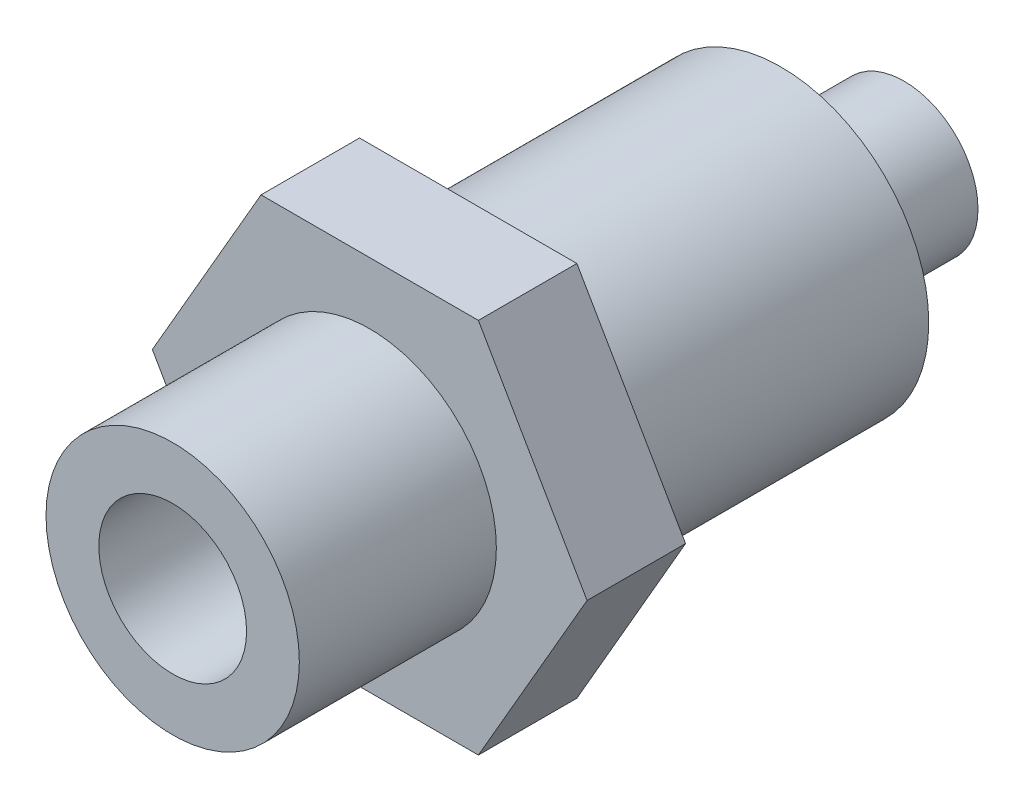
ISO-10303-21;
HEADER;
FILE_DESCRIPTION(('STEP AP214'),'2;1');
FILE_NAME('part.step','',(''),(''),'','','');
FILE_SCHEMA(('AUTOMOTIVE_DESIGN { 1 0 10303 214 1 1 1 1 }'));
ENDSEC;
DATA;
#1=APPLICATION_CONTEXT('core data for automotive mechanical design processes');
#2=APPLICATION_PROTOCOL_DEFINITION('international standard','automotive_design',2000,#1);
#3=PRODUCT_CONTEXT('',#1,'mechanical');
#4=PRODUCT('Part','Part','',(#3));
#5=PRODUCT_RELATED_PRODUCT_CATEGORY('part','',(#4));
#6=PRODUCT_DEFINITION_FORMATION('','',#4);
#7=PRODUCT_DEFINITION_CONTEXT('part definition',#1,'design');
#8=PRODUCT_DEFINITION('design','',#6,#7);
#9=PRODUCT_DEFINITION_SHAPE('','',#8);
#10=(LENGTH_UNIT() NAMED_UNIT(*) SI_UNIT(.MILLI.,.METRE.));
#11=(NAMED_UNIT(*) PLANE_ANGLE_UNIT() SI_UNIT($,.RADIAN.));
#12=(NAMED_UNIT(*) SI_UNIT($,.STERADIAN.) SOLID_ANGLE_UNIT());
#13=UNCERTAINTY_MEASURE_WITH_UNIT(LENGTH_MEASURE(1.E-05),#10,'distance_accuracy_value','');
#14=(GEOMETRIC_REPRESENTATION_CONTEXT(3) GLOBAL_UNCERTAINTY_ASSIGNED_CONTEXT((#13)) GLOBAL_UNIT_ASSIGNED_CONTEXT((#10,
#11,#12)) REPRESENTATION_CONTEXT('',''));
#15=CARTESIAN_POINT('',(0.,0.,0.));
#16=DIRECTION('',(0.,0.,1.));
#17=DIRECTION('',(1.,0.,0.));
#18=AXIS2_PLACEMENT_3D('',#15,#16,#17);
#19=CARTESIAN_POINT('',(0.,-7.6435,-4.));
#20=DIRECTION('',(0.,-1.,0.));
#21=DIRECTION('',(1.,0.,0.));
#22=AXIS2_PLACEMENT_3D('',#19,#20,#21);
#23=PLANE('',#22);
#24=DIRECTION('',(1.,0.,0.));
#25=VECTOR('',#24,1.);
#26=CARTESIAN_POINT('',(0.,-7.6435,0.));
#27=LINE('',#26,#25);
#28=CARTESIAN_POINT('',(-4.41297678255091,-7.6435,0.));
#29=VERTEX_POINT('',#28);
#30=CARTESIAN_POINT('',(4.41297678255091,-7.6435,0.));
#31=VERTEX_POINT('',#30);
#32=EDGE_CURVE('E180',#29,#31,#27,.T.);
#33=ORIENTED_EDGE('',*,*,#32,.F.);
#34=DIRECTION('',(0.,0.,1.));
#35=VECTOR('',#34,1.);
#36=CARTESIAN_POINT('',(-4.41297678255091,-7.6435,-4.));
#37=LINE('',#36,#35);
#38=CARTESIAN_POINT('',(-4.41297678255091,-7.6435,-4.));
#39=VERTEX_POINT('',#38);
#40=EDGE_CURVE('E13',#39,#29,#37,.T.);
#41=ORIENTED_EDGE('',*,*,#40,.F.);
#42=DIRECTION('',(1.,0.,0.));
#43=VECTOR('',#42,1.);
#44=CARTESIAN_POINT('',(0.,-7.6435,-4.));
#45=LINE('',#44,#43);
#46=CARTESIAN_POINT('',(4.41297678255091,-7.6435,-4.));
#47=VERTEX_POINT('',#46);
#48=EDGE_CURVE('E195',#39,#47,#45,.T.);
#49=ORIENTED_EDGE('',*,*,#48,.T.);
#50=DIRECTION('',(0.,0.,1.));
#51=VECTOR('',#50,1.);
#52=CARTESIAN_POINT('',(4.41297678255091,-7.6435,-4.));
#53=LINE('',#52,#51);
#54=EDGE_CURVE('E144',#47,#31,#53,.T.);
#55=ORIENTED_EDGE('',*,*,#54,.T.);
#56=EDGE_LOOP('',(#33,#41,#49,#55));
#57=FACE_BOUND('',#56,.T.);
#58=ADVANCED_FACE('F93',(#57),#23,.T.);
#59=CARTESIAN_POINT('',(-6.61946517382636,-3.82175,-4.));
#60=DIRECTION('',(-0.866025403784439,-0.5,0.));
#61=DIRECTION('',(0.5,-0.866025403784439,0.));
#62=AXIS2_PLACEMENT_3D('',#59,#60,#61);
#63=PLANE('',#62);
#64=DIRECTION('',(0.5,-0.866025403784439,0.));
#65=VECTOR('',#64,1.);
#66=CARTESIAN_POINT('',(-6.61946517382636,-3.82175,0.));
#67=LINE('',#66,#65);
#68=CARTESIAN_POINT('',(-8.82595356510181,0.,0.));
#69=VERTEX_POINT('',#68);
#70=EDGE_CURVE('E193',#69,#29,#67,.T.);
#71=ORIENTED_EDGE('',*,*,#70,.F.);
#72=DIRECTION('',(0.,0.,1.));
#73=VECTOR('',#72,1.);
#74=CARTESIAN_POINT('',(-8.82595356510181,0.,-4.));
#75=LINE('',#74,#73);
#76=CARTESIAN_POINT('',(-8.82595356510181,0.,-4.));
#77=VERTEX_POINT('',#76);
#78=EDGE_CURVE('E103',#77,#69,#75,.T.);
#79=ORIENTED_EDGE('',*,*,#78,.F.);
#80=DIRECTION('',(0.5,-0.866025403784439,0.));
#81=VECTOR('',#80,1.);
#82=CARTESIAN_POINT('',(-6.61946517382636,-3.82175,-4.));
#83=LINE('',#82,#81);
#84=EDGE_CURVE('E170',#77,#39,#83,.T.);
#85=ORIENTED_EDGE('',*,*,#84,.T.);
#86=ORIENTED_EDGE('',*,*,#40,.T.);
#87=EDGE_LOOP('',(#71,#79,#85,#86));
#88=FACE_BOUND('',#87,.T.);
#89=ADVANCED_FACE('F225',(#88),#63,.T.);
#90=CARTESIAN_POINT('',(-6.61946517382636,3.82175,-4.));
#91=DIRECTION('',(-0.866025403784439,0.5,0.));
#92=DIRECTION('',(-0.5,-0.866025403784439,0.));
#93=AXIS2_PLACEMENT_3D('',#90,#91,#92);
#94=PLANE('',#93);
#95=DIRECTION('',(-0.5,-0.866025403784439,0.));
#96=VECTOR('',#95,1.);
#97=CARTESIAN_POINT('',(-6.61946517382636,3.82175,0.));
#98=LINE('',#97,#96);
#99=CARTESIAN_POINT('',(-4.41297678255091,7.6435,0.));
#100=VERTEX_POINT('',#99);
#101=EDGE_CURVE('E157',#100,#69,#98,.T.);
#102=ORIENTED_EDGE('',*,*,#101,.F.);
#103=DIRECTION('',(0.,0.,1.));
#104=VECTOR('',#103,1.);
#105=CARTESIAN_POINT('',(-4.41297678255091,7.6435,-4.));
#106=LINE('',#105,#104);
#107=CARTESIAN_POINT('',(-4.41297678255091,7.6435,-4.));
#108=VERTEX_POINT('',#107);
#109=EDGE_CURVE('E152',#108,#100,#106,.T.);
#110=ORIENTED_EDGE('',*,*,#109,.F.);
#111=DIRECTION('',(-0.5,-0.866025403784439,0.));
#112=VECTOR('',#111,1.);
#113=CARTESIAN_POINT('',(-6.61946517382636,3.82175,-4.));
#114=LINE('',#113,#112);
#115=EDGE_CURVE('E155',#108,#77,#114,.T.);
#116=ORIENTED_EDGE('',*,*,#115,.T.);
#117=ORIENTED_EDGE('',*,*,#78,.T.);
#118=EDGE_LOOP('',(#102,#110,#116,#117));
#119=FACE_BOUND('',#118,.T.);
#120=ADVANCED_FACE('F154',(#119),#94,.T.);
#121=CARTESIAN_POINT('',(0.,7.6435,-4.));
#122=DIRECTION('',(0.,1.,0.));
#123=DIRECTION('',(-1.,0.,0.));
#124=AXIS2_PLACEMENT_3D('',#121,#122,#123);
#125=PLANE('',#124);
#126=DIRECTION('',(-1.,0.,0.));
#127=VECTOR('',#126,1.);
#128=CARTESIAN_POINT('',(0.,7.6435,0.));
#129=LINE('',#128,#127);
#130=CARTESIAN_POINT('',(4.4129767825509,7.6435,0.));
#131=VERTEX_POINT('',#130);
#132=EDGE_CURVE('E190',#131,#100,#129,.T.);
#133=ORIENTED_EDGE('',*,*,#132,.F.);
#134=DIRECTION('',(0.,0.,1.));
#135=VECTOR('',#134,1.);
#136=CARTESIAN_POINT('',(4.4129767825509,7.6435,-4.));
#137=LINE('',#136,#135);
#138=CARTESIAN_POINT('',(4.4129767825509,7.6435,-4.));
#139=VERTEX_POINT('',#138);
#140=EDGE_CURVE('E162',#139,#131,#137,.T.);
#141=ORIENTED_EDGE('',*,*,#140,.F.);
#142=DIRECTION('',(-1.,0.,0.));
#143=VECTOR('',#142,1.);
#144=CARTESIAN_POINT('',(0.,7.6435,-4.));
#145=LINE('',#144,#143);
#146=EDGE_CURVE('E168',#139,#108,#145,.T.);
#147=ORIENTED_EDGE('',*,*,#146,.T.);
#148=ORIENTED_EDGE('',*,*,#109,.T.);
#149=EDGE_LOOP('',(#133,#141,#147,#148));
#150=FACE_BOUND('',#149,.T.);
#151=ADVANCED_FACE('F172',(#150),#125,.T.);
#152=CARTESIAN_POINT('',(6.61946517382636,3.82175,-4.));
#153=DIRECTION('',(0.866025403784439,0.5,0.));
#154=DIRECTION('',(-0.5,0.866025403784439,0.));
#155=AXIS2_PLACEMENT_3D('',#152,#153,#154);
#156=PLANE('',#155);
#157=DIRECTION('',(-0.5,0.866025403784439,0.));
#158=VECTOR('',#157,1.);
#159=CARTESIAN_POINT('',(6.61946517382636,3.82175,0.));
#160=LINE('',#159,#158);
#161=CARTESIAN_POINT('',(8.82595356510181,0.,0.));
#162=VERTEX_POINT('',#161);
#163=EDGE_CURVE('E187',#162,#131,#160,.T.);
#164=ORIENTED_EDGE('',*,*,#163,.F.);
#165=DIRECTION('',(0.,0.,1.));
#166=VECTOR('',#165,1.);
#167=CARTESIAN_POINT('',(8.82595356510181,0.,-4.));
#168=LINE('',#167,#166);
#169=CARTESIAN_POINT('',(8.82595356510181,0.,-4.));
#170=VERTEX_POINT('',#169);
#171=EDGE_CURVE('E199',#170,#162,#168,.T.);
#172=ORIENTED_EDGE('',*,*,#171,.F.);
#173=DIRECTION('',(-0.5,0.866025403784439,0.));
#174=VECTOR('',#173,1.);
#175=CARTESIAN_POINT('',(6.61946517382636,3.82175,-4.));
#176=LINE('',#175,#174);
#177=EDGE_CURVE('E173',#170,#139,#176,.T.);
#178=ORIENTED_EDGE('',*,*,#177,.T.);
#179=ORIENTED_EDGE('',*,*,#140,.T.);
#180=EDGE_LOOP('',(#164,#172,#178,#179));
#181=FACE_BOUND('',#180,.T.);
#182=ADVANCED_FACE('F311',(#181),#156,.T.);
#183=CARTESIAN_POINT('',(6.61946517382636,-3.82175,-4.));
#184=DIRECTION('',(0.866025403784439,-0.5,0.));
#185=DIRECTION('',(0.5,0.866025403784439,0.));
#186=AXIS2_PLACEMENT_3D('',#183,#184,#185);
#187=PLANE('',#186);
#188=DIRECTION('',(0.5,0.866025403784439,0.));
#189=VECTOR('',#188,1.);
#190=CARTESIAN_POINT('',(6.61946517382636,-3.82175,0.));
#191=LINE('',#190,#189);
#192=EDGE_CURVE('E183',#31,#162,#191,.T.);
#193=ORIENTED_EDGE('',*,*,#192,.F.);
#194=ORIENTED_EDGE('',*,*,#54,.F.);
#195=DIRECTION('',(0.5,0.866025403784439,0.));
#196=VECTOR('',#195,1.);
#197=CARTESIAN_POINT('',(6.61946517382636,-3.82175,-4.));
#198=LINE('',#197,#196);
#199=EDGE_CURVE('E175',#47,#170,#198,.T.);
#200=ORIENTED_EDGE('',*,*,#199,.T.);
#201=ORIENTED_EDGE('',*,*,#171,.T.);
#202=EDGE_LOOP('',(#193,#194,#200,#201));
#203=FACE_BOUND('',#202,.T.);
#204=ADVANCED_FACE('F220',(#203),#187,.T.);
#205=CARTESIAN_POINT('',(0.,0.,-4.));
#206=DIRECTION('',(0.,0.,1.));
#207=DIRECTION('',(1.,0.,0.));
#208=AXIS2_PLACEMENT_3D('',#205,#206,#207);
#209=PLANE('',#208);
#210=CARTESIAN_POINT('',(0.,0.,-4.));
#211=DIRECTION('',(0.,0.,1.));
#212=DIRECTION('',(1.,0.,0.));
#213=AXIS2_PLACEMENT_3D('',#210,#211,#212);
#214=CIRCLE('',#213,6.);
#215=CARTESIAN_POINT('',(6.,0.,-4.));
#216=VERTEX_POINT('',#215);
#217=EDGE_CURVE('E209',#216,#216,#214,.T.);
#218=ORIENTED_EDGE('',*,*,#217,.T.);
#219=EDGE_LOOP('',(#218));
#220=FACE_BOUND('',#219,.T.);
#221=ORIENTED_EDGE('',*,*,#48,.F.);
#222=ORIENTED_EDGE('',*,*,#84,.F.);
#223=ORIENTED_EDGE('',*,*,#115,.F.);
#224=ORIENTED_EDGE('',*,*,#146,.F.);
#225=ORIENTED_EDGE('',*,*,#177,.F.);
#226=ORIENTED_EDGE('',*,*,#199,.F.);
#227=EDGE_LOOP('',(#221,#222,#223,#224,#225,#226));
#228=FACE_BOUND('',#227,.T.);
#229=ADVANCED_FACE('F166',(#220,#228),#209,.F.);
#230=CARTESIAN_POINT('',(0.,0.,0.));
#231=DIRECTION('',(0.,0.,1.));
#232=DIRECTION('',(1.,0.,0.));
#233=AXIS2_PLACEMENT_3D('',#230,#231,#232);
#234=PLANE('',#233);
#235=ORIENTED_EDGE('',*,*,#32,.T.);
#236=ORIENTED_EDGE('',*,*,#192,.T.);
#237=ORIENTED_EDGE('',*,*,#163,.T.);
#238=ORIENTED_EDGE('',*,*,#132,.T.);
#239=ORIENTED_EDGE('',*,*,#101,.T.);
#240=ORIENTED_EDGE('',*,*,#70,.T.);
#241=EDGE_LOOP('',(#235,#236,#237,#238,#239,#240));
#242=FACE_BOUND('',#241,.T.);
#243=CARTESIAN_POINT('',(0.,0.,0.));
#244=DIRECTION('',(0.,0.,1.));
#245=DIRECTION('',(1.,0.,0.));
#246=AXIS2_PLACEMENT_3D('',#243,#244,#245);
#247=CIRCLE('',#246,5.1435);
#248=CARTESIAN_POINT('',(5.1435,0.,0.));
#249=VERTEX_POINT('',#248);
#250=EDGE_CURVE('E184',#249,#249,#247,.T.);
#251=ORIENTED_EDGE('',*,*,#250,.F.);
#252=EDGE_LOOP('',(#251));
#253=FACE_BOUND('',#252,.T.);
#254=ADVANCED_FACE('F223',(#242,#253),#234,.T.);
#255=CARTESIAN_POINT('',(0.,0.,-4.));
#256=DIRECTION('',(0.,0.,1.));
#257=DIRECTION('',(1.,0.,0.));
#258=AXIS2_PLACEMENT_3D('',#255,#256,#257);
#259=CYLINDRICAL_SURFACE('',#258,5.1435);
#260=CARTESIAN_POINT('',(0.,0.,-4.));
#261=DIRECTION('',(0.,0.,1.));
#262=DIRECTION('',(1.,0.,0.));
#263=AXIS2_PLACEMENT_3D('',#260,#261,#262);
#264=CIRCLE('',#263,5.1435);
#265=CARTESIAN_POINT('',(5.1435,0.,-4.));
#266=VERTEX_POINT('',#265);
#267=EDGE_CURVE('E97',#266,#266,#264,.T.);
#268=ORIENTED_EDGE('',*,*,#267,.F.);
#269=EDGE_LOOP('',(#268));
#270=FACE_BOUND('',#269,.T.);
#271=ORIENTED_EDGE('',*,*,#250,.T.);
#272=EDGE_LOOP('',(#271));
#273=FACE_BOUND('',#272,.T.);
#274=ADVANCED_FACE('F95',(#270,#273),#259,.F.);
#275=CARTESIAN_POINT('',(0.,0.,-4.));
#276=DIRECTION('',(0.,0.,1.));
#277=DIRECTION('',(1.,0.,0.));
#278=AXIS2_PLACEMENT_3D('',#275,#276,#277);
#279=PLANE('',#278);
#280=ORIENTED_EDGE('',*,*,#267,.T.);
#281=EDGE_LOOP('',(#280));
#282=FACE_BOUND('',#281,.T.);
#283=ADVANCED_FACE('F235',(#282),#279,.T.);
#284=CARTESIAN_POINT('',(0.,0.,-16.7));
#285=DIRECTION('',(0.,0.,1.));
#286=DIRECTION('',(1.,0.,0.));
#287=AXIS2_PLACEMENT_3D('',#284,#285,#286);
#288=CYLINDRICAL_SURFACE('',#287,6.);
#289=CARTESIAN_POINT('',(0.,0.,-16.7));
#290=DIRECTION('',(0.,0.,1.));
#291=DIRECTION('',(1.,0.,0.));
#292=AXIS2_PLACEMENT_3D('',#289,#290,#291);
#293=CIRCLE('',#292,6.);
#294=CARTESIAN_POINT('',(6.,0.,-16.7));
#295=VERTEX_POINT('',#294);
#296=EDGE_CURVE('E205',#295,#295,#293,.T.);
#297=ORIENTED_EDGE('',*,*,#296,.T.);
#298=EDGE_LOOP('',(#297));
#299=FACE_BOUND('',#298,.T.);
#300=ORIENTED_EDGE('',*,*,#217,.F.);
#301=EDGE_LOOP('',(#300));
#302=FACE_BOUND('',#301,.T.);
#303=ADVANCED_FACE('F241',(#299,#302),#288,.T.);
#304=CARTESIAN_POINT('',(0.,0.,-16.7));
#305=DIRECTION('',(0.,0.,1.));
#306=DIRECTION('',(1.,0.,0.));
#307=AXIS2_PLACEMENT_3D('',#304,#305,#306);
#308=PLANE('',#307);
#309=CARTESIAN_POINT('',(0.,0.,-16.7));
#310=DIRECTION('',(0.,0.,1.));
#311=DIRECTION('',(1.,0.,0.));
#312=AXIS2_PLACEMENT_3D('',#309,#310,#311);
#313=CIRCLE('',#312,3.);
#314=CARTESIAN_POINT('',(3.,0.,-16.7));
#315=VERTEX_POINT('',#314);
#316=EDGE_CURVE('E217',#315,#315,#313,.T.);
#317=ORIENTED_EDGE('',*,*,#316,.T.);
#318=EDGE_LOOP('',(#317));
#319=FACE_BOUND('',#318,.T.);
#320=ORIENTED_EDGE('',*,*,#296,.F.);
#321=EDGE_LOOP('',(#320));
#322=FACE_BOUND('',#321,.T.);
#323=ADVANCED_FACE('F250',(#319,#322),#308,.F.);
#324=CARTESIAN_POINT('',(0.,0.,-21.7));
#325=DIRECTION('',(0.,0.,1.));
#326=DIRECTION('',(1.,0.,0.));
#327=AXIS2_PLACEMENT_3D('',#324,#325,#326);
#328=CYLINDRICAL_SURFACE('',#327,3.);
#329=CARTESIAN_POINT('',(0.,0.,-21.7));
#330=DIRECTION('',(0.,0.,1.));
#331=DIRECTION('',(1.,0.,0.));
#332=AXIS2_PLACEMENT_3D('',#329,#330,#331);
#333=CIRCLE('',#332,3.);
#334=CARTESIAN_POINT('',(3.,0.,-21.7));
#335=VERTEX_POINT('',#334);
#336=EDGE_CURVE('E214',#335,#335,#333,.T.);
#337=ORIENTED_EDGE('',*,*,#336,.T.);
#338=EDGE_LOOP('',(#337));
#339=FACE_BOUND('',#338,.T.);
#340=ORIENTED_EDGE('',*,*,#316,.F.);
#341=EDGE_LOOP('',(#340));
#342=FACE_BOUND('',#341,.T.);
#343=ADVANCED_FACE('F254',(#339,#342),#328,.T.);
#344=CARTESIAN_POINT('',(0.,0.,-21.7));
#345=DIRECTION('',(0.,0.,1.));
#346=DIRECTION('',(1.,0.,0.));
#347=AXIS2_PLACEMENT_3D('',#344,#345,#346);
#348=PLANE('',#347);
#349=ORIENTED_EDGE('',*,*,#336,.F.);
#350=EDGE_LOOP('',(#349));
#351=FACE_BOUND('',#350,.T.);
#352=ADVANCED_FACE('F258',(#351),#348,.F.);
#353=CLOSED_SHELL('',(#58,#89,#120,#151,#182,#204,#229,#254,#274,#283,#303,#323,#343,#352));
#354=MANIFOLD_SOLID_BREP('B2',#353);
#355=CARTESIAN_POINT('',(0.,0.,8.));
#356=DIRECTION('',(0.,0.,-1.));
#357=DIRECTION('',(-1.,0.,0.));
#358=AXIS2_PLACEMENT_3D('',#355,#356,#357);
#359=CYLINDRICAL_SURFACE('',#358,3.);
#360=CARTESIAN_POINT('',(0.,0.,8.));
#361=DIRECTION('',(0.,0.,1.));
#362=DIRECTION('',(1.,0.,0.));
#363=AXIS2_PLACEMENT_3D('',#360,#361,#362);
#364=CIRCLE('',#363,3.);
#365=CARTESIAN_POINT('',(3.,0.,8.));
#366=VERTEX_POINT('',#365);
#367=EDGE_CURVE('E372',#366,#366,#364,.T.);
#368=ORIENTED_EDGE('',*,*,#367,.T.);
#369=EDGE_LOOP('',(#368));
#370=FACE_BOUND('',#369,.T.);
#371=CARTESIAN_POINT('',(0.,0.,0.));
#372=DIRECTION('',(0.,0.,1.));
#373=DIRECTION('',(1.,0.,0.));
#374=AXIS2_PLACEMENT_3D('',#371,#372,#373);
#375=CIRCLE('',#374,3.);
#376=CARTESIAN_POINT('',(3.,0.,0.));
#377=VERTEX_POINT('',#376);
#378=EDGE_CURVE('E378',#377,#377,#375,.T.);
#379=ORIENTED_EDGE('',*,*,#378,.F.);
#380=EDGE_LOOP('',(#379));
#381=FACE_BOUND('',#380,.T.);
#382=ADVANCED_FACE('F365',(#370,#381),#359,.F.);
#383=CARTESIAN_POINT('',(0.,0.,8.));
#384=DIRECTION('',(0.,0.,-1.));
#385=DIRECTION('',(-1.,0.,0.));
#386=AXIS2_PLACEMENT_3D('',#383,#384,#385);
#387=CYLINDRICAL_SURFACE('',#386,5.1435);
#388=CARTESIAN_POINT('',(0.,0.,8.));
#389=DIRECTION('',(0.,0.,1.));
#390=DIRECTION('',(1.,0.,0.));
#391=AXIS2_PLACEMENT_3D('',#388,#389,#390);
#392=CIRCLE('',#391,5.1435);
#393=CARTESIAN_POINT('',(5.1435,0.,8.));
#394=VERTEX_POINT('',#393);
#395=EDGE_CURVE('E92',#394,#394,#392,.T.);
#396=ORIENTED_EDGE('',*,*,#395,.F.);
#397=EDGE_LOOP('',(#396));
#398=FACE_BOUND('',#397,.T.);
#399=CARTESIAN_POINT('',(0.,0.,0.));
#400=DIRECTION('',(0.,0.,1.));
#401=DIRECTION('',(1.,0.,0.));
#402=AXIS2_PLACEMENT_3D('',#399,#400,#401);
#403=CIRCLE('',#402,5.1435);
#404=CARTESIAN_POINT('',(5.1435,0.,0.));
#405=VERTEX_POINT('',#404);
#406=EDGE_CURVE('E368',#405,#405,#403,.T.);
#407=ORIENTED_EDGE('',*,*,#406,.T.);
#408=EDGE_LOOP('',(#407));
#409=FACE_BOUND('',#408,.T.);
#410=ADVANCED_FACE('F385',(#398,#409),#387,.T.);
#411=CARTESIAN_POINT('',(0.,0.,8.));
#412=DIRECTION('',(0.,0.,1.));
#413=DIRECTION('',(1.,0.,0.));
#414=AXIS2_PLACEMENT_3D('',#411,#412,#413);
#415=PLANE('',#414);
#416=ORIENTED_EDGE('',*,*,#367,.F.);
#417=EDGE_LOOP('',(#416));
#418=FACE_BOUND('',#417,.T.);
#419=ORIENTED_EDGE('',*,*,#395,.T.);
#420=EDGE_LOOP('',(#419));
#421=FACE_BOUND('',#420,.T.);
#422=ADVANCED_FACE('F389',(#418,#421),#415,.T.);
#423=CARTESIAN_POINT('',(0.,0.,0.));
#424=DIRECTION('',(0.,0.,1.));
#425=DIRECTION('',(1.,0.,0.));
#426=AXIS2_PLACEMENT_3D('',#423,#424,#425);
#427=PLANE('',#426);
#428=ORIENTED_EDGE('',*,*,#378,.T.);
#429=EDGE_LOOP('',(#428));
#430=FACE_BOUND('',#429,.T.);
#431=ORIENTED_EDGE('',*,*,#406,.F.);
#432=EDGE_LOOP('',(#431));
#433=FACE_BOUND('',#432,.T.);
#434=ADVANCED_FACE('F387',(#430,#433),#427,.F.);
#435=CLOSED_SHELL('',(#382,#410,#422,#434));
#436=MANIFOLD_SOLID_BREP('B7',#435);
#437=ADVANCED_BREP_SHAPE_REPRESENTATION('',(#18,#354,#436),#14);
#438=SHAPE_DEFINITION_REPRESENTATION(#9,#437);
ENDSEC;
END-ISO-10303-21;
